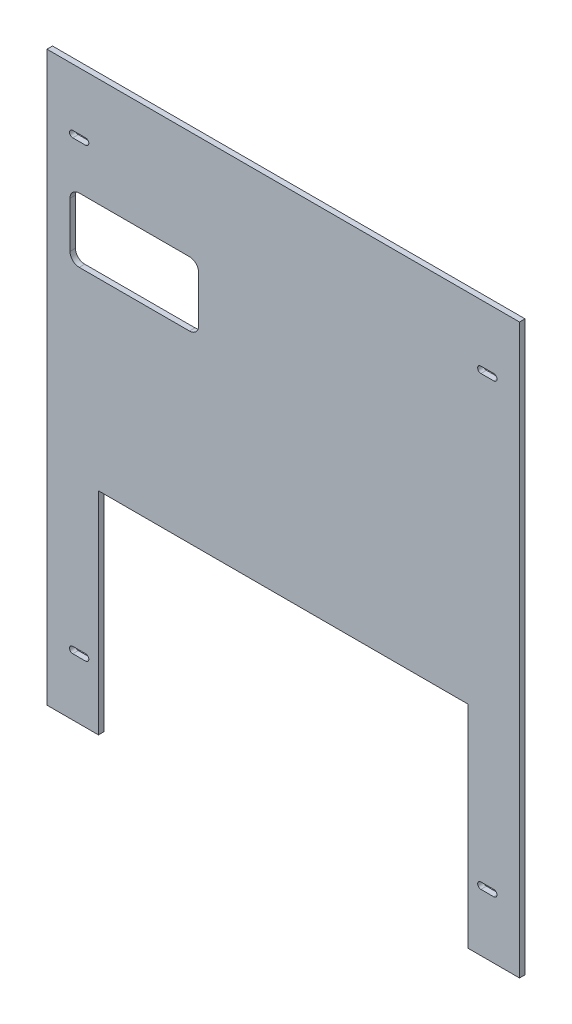
ISO-10303-21;
HEADER;
FILE_DESCRIPTION(('STEP AP214'),'2;1');
FILE_NAME('part.step','',(''),(''),'','','');
FILE_SCHEMA(('AUTOMOTIVE_DESIGN { 1 0 10303 214 1 1 1 1 }'));
ENDSEC;
DATA;
#1=APPLICATION_CONTEXT('core data for automotive mechanical design processes');
#2=APPLICATION_PROTOCOL_DEFINITION('international standard','automotive_design',2000,#1);
#3=PRODUCT_CONTEXT('',#1,'mechanical');
#4=PRODUCT('Part','Part','',(#3));
#5=PRODUCT_RELATED_PRODUCT_CATEGORY('part','',(#4));
#6=PRODUCT_DEFINITION_FORMATION('','',#4);
#7=PRODUCT_DEFINITION_CONTEXT('part definition',#1,'design');
#8=PRODUCT_DEFINITION('design','',#6,#7);
#9=PRODUCT_DEFINITION_SHAPE('','',#8);
#10=(LENGTH_UNIT() NAMED_UNIT(*) SI_UNIT(.MILLI.,.METRE.));
#11=(NAMED_UNIT(*) PLANE_ANGLE_UNIT() SI_UNIT($,.RADIAN.));
#12=(NAMED_UNIT(*) SI_UNIT($,.STERADIAN.) SOLID_ANGLE_UNIT());
#13=UNCERTAINTY_MEASURE_WITH_UNIT(LENGTH_MEASURE(1.E-05),#10,'distance_accuracy_value','');
#14=(GEOMETRIC_REPRESENTATION_CONTEXT(3) GLOBAL_UNCERTAINTY_ASSIGNED_CONTEXT((#13)) GLOBAL_UNIT_ASSIGNED_CONTEXT((#10,
#11,#12)) REPRESENTATION_CONTEXT('',''));
#15=CARTESIAN_POINT('',(0.,0.,0.));
#16=DIRECTION('',(0.,0.,1.));
#17=DIRECTION('',(1.,0.,0.));
#18=AXIS2_PLACEMENT_3D('',#15,#16,#17);
#19=CARTESIAN_POINT('',(128.5,-154.5,3.));
#20=DIRECTION('',(0.,1.,0.));
#21=DIRECTION('',(-1.,0.,0.));
#22=AXIS2_PLACEMENT_3D('',#19,#20,#21);
#23=PLANE('',#22);
#24=DIRECTION('',(1.,0.,0.));
#25=VECTOR('',#24,1.);
#26=CARTESIAN_POINT('',(128.5,-154.5,0.));
#27=LINE('',#26,#25);
#28=CARTESIAN_POINT('',(-128.5,-154.5,0.));
#29=VERTEX_POINT('',#28);
#30=CARTESIAN_POINT('',(-100.5,-154.5,0.));
#31=VERTEX_POINT('',#30);
#32=EDGE_CURVE('E532',#29,#31,#27,.T.);
#33=ORIENTED_EDGE('',*,*,#32,.T.);
#34=DIRECTION('',(0.,0.,1.));
#35=VECTOR('',#34,1.);
#36=CARTESIAN_POINT('',(-100.5,-154.5,0.));
#37=LINE('',#36,#35);
#38=CARTESIAN_POINT('',(-100.5,-154.5,3.));
#39=VERTEX_POINT('',#38);
#40=EDGE_CURVE('E334',#31,#39,#37,.T.);
#41=ORIENTED_EDGE('',*,*,#40,.T.);
#42=DIRECTION('',(1.,0.,0.));
#43=VECTOR('',#42,1.);
#44=CARTESIAN_POINT('',(128.5,-154.5,3.));
#45=LINE('',#44,#43);
#46=CARTESIAN_POINT('',(-128.5,-154.5,3.));
#47=VERTEX_POINT('',#46);
#48=EDGE_CURVE('E516',#47,#39,#45,.T.);
#49=ORIENTED_EDGE('',*,*,#48,.F.);
#50=DIRECTION('',(0.,0.,-1.));
#51=VECTOR('',#50,1.);
#52=CARTESIAN_POINT('',(-128.5,-154.5,3.));
#53=LINE('',#52,#51);
#54=EDGE_CURVE('E12',#47,#29,#53,.T.);
#55=ORIENTED_EDGE('',*,*,#54,.T.);
#56=EDGE_LOOP('',(#33,#41,#49,#55));
#57=FACE_BOUND('',#56,.T.);
#58=ADVANCED_FACE('F48',(#57),#23,.F.);
#59=CARTESIAN_POINT('',(0.,0.,3.));
#60=DIRECTION('',(0.,0.,-1.));
#61=DIRECTION('',(-1.,0.,0.));
#62=AXIS2_PLACEMENT_3D('',#59,#60,#61);
#63=PLANE('',#62);
#64=DIRECTION('',(1.,0.,0.));
#65=VECTOR('',#64,1.);
#66=CARTESIAN_POINT('',(-111.,60.5000000000001,3.));
#67=LINE('',#66,#65);
#68=CARTESIAN_POINT('',(-111.,60.5000000000001,3.));
#69=VERTEX_POINT('',#68);
#70=CARTESIAN_POINT('',(-51.,60.5000000000001,3.));
#71=VERTEX_POINT('',#70);
#72=EDGE_CURVE('E297',#69,#71,#67,.T.);
#73=ORIENTED_EDGE('',*,*,#72,.F.);
#74=CARTESIAN_POINT('',(-111.,65.5000000000001,3.));
#75=DIRECTION('',(0.,0.,1.));
#76=DIRECTION('',(-1.,0.,0.));
#77=AXIS2_PLACEMENT_3D('',#74,#75,#76);
#78=CIRCLE('',#77,5.);
#79=CARTESIAN_POINT('',(-116.,65.5000000000001,3.));
#80=VERTEX_POINT('',#79);
#81=EDGE_CURVE('E63',#80,#69,#78,.T.);
#82=ORIENTED_EDGE('',*,*,#81,.F.);
#83=DIRECTION('',(0.,-1.,0.));
#84=VECTOR('',#83,1.);
#85=CARTESIAN_POINT('',(-116.,65.5000000000001,3.));
#86=LINE('',#85,#84);
#87=CARTESIAN_POINT('',(-116.,90.5000000000001,3.));
#88=VERTEX_POINT('',#87);
#89=EDGE_CURVE('E276',#88,#80,#86,.T.);
#90=ORIENTED_EDGE('',*,*,#89,.F.);
#91=CARTESIAN_POINT('',(-111.,90.5000000000001,3.));
#92=DIRECTION('',(0.,0.,1.));
#93=DIRECTION('',(-1.,0.,0.));
#94=AXIS2_PLACEMENT_3D('',#91,#92,#93);
#95=CIRCLE('',#94,5.);
#96=CARTESIAN_POINT('',(-111.,95.5000000000001,3.));
#97=VERTEX_POINT('',#96);
#98=EDGE_CURVE('E279',#97,#88,#95,.T.);
#99=ORIENTED_EDGE('',*,*,#98,.F.);
#100=DIRECTION('',(-1.,0.,0.));
#101=VECTOR('',#100,1.);
#102=CARTESIAN_POINT('',(-111.,95.5000000000001,3.));
#103=LINE('',#102,#101);
#104=CARTESIAN_POINT('',(-51.,95.5000000000001,3.));
#105=VERTEX_POINT('',#104);
#106=EDGE_CURVE('E720',#105,#97,#103,.T.);
#107=ORIENTED_EDGE('',*,*,#106,.F.);
#108=CARTESIAN_POINT('',(-51.,90.5000000000001,3.));
#109=DIRECTION('',(0.,0.,1.));
#110=DIRECTION('',(-1.,0.,0.));
#111=AXIS2_PLACEMENT_3D('',#108,#109,#110);
#112=CIRCLE('',#111,5.);
#113=CARTESIAN_POINT('',(-46.,90.5000000000001,3.));
#114=VERTEX_POINT('',#113);
#115=EDGE_CURVE('E713',#114,#105,#112,.T.);
#116=ORIENTED_EDGE('',*,*,#115,.F.);
#117=DIRECTION('',(0.,1.,0.));
#118=VECTOR('',#117,1.);
#119=CARTESIAN_POINT('',(-46.,65.5000000000001,3.));
#120=LINE('',#119,#118);
#121=CARTESIAN_POINT('',(-46.,65.5000000000001,3.));
#122=VERTEX_POINT('',#121);
#123=EDGE_CURVE('E711',#122,#114,#120,.T.);
#124=ORIENTED_EDGE('',*,*,#123,.F.);
#125=CARTESIAN_POINT('',(-51.,65.5000000000001,3.));
#126=DIRECTION('',(0.,0.,1.));
#127=DIRECTION('',(1.,0.,0.));
#128=AXIS2_PLACEMENT_3D('',#125,#126,#127);
#129=CIRCLE('',#128,5.);
#130=EDGE_CURVE('E710',#71,#122,#129,.T.);
#131=ORIENTED_EDGE('',*,*,#130,.F.);
#132=EDGE_LOOP('',(#73,#82,#90,#99,#107,#116,#124,#131));
#133=FACE_BOUND('',#132,.T.);
#134=CARTESIAN_POINT('',(-114.5,-121.5,3.));
#135=DIRECTION('',(0.,0.,1.));
#136=DIRECTION('',(1.,0.,0.));
#137=AXIS2_PLACEMENT_3D('',#134,#135,#136);
#138=CIRCLE('',#137,1.75);
#139=CARTESIAN_POINT('',(-114.5,-119.75,3.));
#140=VERTEX_POINT('',#139);
#141=CARTESIAN_POINT('',(-114.5,-123.25,3.));
#142=VERTEX_POINT('',#141);
#143=EDGE_CURVE('E397',#140,#142,#138,.T.);
#144=ORIENTED_EDGE('',*,*,#143,.F.);
#145=DIRECTION('',(-1.,0.,0.));
#146=VECTOR('',#145,1.);
#147=CARTESIAN_POINT('',(-114.5,-119.75,3.));
#148=LINE('',#147,#146);
#149=CARTESIAN_POINT('',(-107.5,-119.75,3.));
#150=VERTEX_POINT('',#149);
#151=EDGE_CURVE('E411',#150,#140,#148,.T.);
#152=ORIENTED_EDGE('',*,*,#151,.F.);
#153=CARTESIAN_POINT('',(-107.5,-121.5,3.));
#154=DIRECTION('',(0.,0.,1.));
#155=DIRECTION('',(1.,0.,0.));
#156=AXIS2_PLACEMENT_3D('',#153,#154,#155);
#157=CIRCLE('',#156,1.75);
#158=CARTESIAN_POINT('',(-107.5,-123.25,3.));
#159=VERTEX_POINT('',#158);
#160=EDGE_CURVE('E415',#159,#150,#157,.T.);
#161=ORIENTED_EDGE('',*,*,#160,.F.);
#162=DIRECTION('',(1.,0.,0.));
#163=VECTOR('',#162,1.);
#164=CARTESIAN_POINT('',(-114.5,-123.25,3.));
#165=LINE('',#164,#163);
#166=EDGE_CURVE('E400',#142,#159,#165,.T.);
#167=ORIENTED_EDGE('',*,*,#166,.F.);
#168=EDGE_LOOP('',(#144,#152,#161,#167));
#169=FACE_BOUND('',#168,.T.);
#170=CARTESIAN_POINT('',(-114.5,121.5,3.));
#171=DIRECTION('',(0.,0.,1.));
#172=DIRECTION('',(1.,0.,0.));
#173=AXIS2_PLACEMENT_3D('',#170,#171,#172);
#174=CIRCLE('',#173,1.75);
#175=CARTESIAN_POINT('',(-114.5,123.25,3.));
#176=VERTEX_POINT('',#175);
#177=CARTESIAN_POINT('',(-114.5,119.75,3.));
#178=VERTEX_POINT('',#177);
#179=EDGE_CURVE('E475',#176,#178,#174,.T.);
#180=ORIENTED_EDGE('',*,*,#179,.F.);
#181=DIRECTION('',(-1.,0.,0.));
#182=VECTOR('',#181,1.);
#183=CARTESIAN_POINT('',(-114.5,123.25,3.));
#184=LINE('',#183,#182);
#185=CARTESIAN_POINT('',(-107.5,123.25,3.));
#186=VERTEX_POINT('',#185);
#187=EDGE_CURVE('E486',#186,#176,#184,.T.);
#188=ORIENTED_EDGE('',*,*,#187,.F.);
#189=CARTESIAN_POINT('',(-107.5,121.5,3.));
#190=DIRECTION('',(0.,0.,1.));
#191=DIRECTION('',(1.,0.,0.));
#192=AXIS2_PLACEMENT_3D('',#189,#190,#191);
#193=CIRCLE('',#192,1.75);
#194=CARTESIAN_POINT('',(-107.5,119.75,3.));
#195=VERTEX_POINT('',#194);
#196=EDGE_CURVE('E490',#195,#186,#193,.T.);
#197=ORIENTED_EDGE('',*,*,#196,.F.);
#198=DIRECTION('',(1.,0.,0.));
#199=VECTOR('',#198,1.);
#200=CARTESIAN_POINT('',(-114.5,119.75,3.));
#201=LINE('',#200,#199);
#202=EDGE_CURVE('E478',#178,#195,#201,.T.);
#203=ORIENTED_EDGE('',*,*,#202,.F.);
#204=EDGE_LOOP('',(#180,#188,#197,#203));
#205=FACE_BOUND('',#204,.T.);
#206=ORIENTED_EDGE('',*,*,#48,.T.);
#207=DIRECTION('',(0.,-1.,0.));
#208=VECTOR('',#207,1.);
#209=CARTESIAN_POINT('',(-100.5,-154.5,3.));
#210=LINE('',#209,#208);
#211=CARTESIAN_POINT('',(-100.5,-39.4999999999999,3.));
#212=VERTEX_POINT('',#211);
#213=EDGE_CURVE('E312',#212,#39,#210,.T.);
#214=ORIENTED_EDGE('',*,*,#213,.F.);
#215=DIRECTION('',(-1.,0.,0.));
#216=VECTOR('',#215,1.);
#217=CARTESIAN_POINT('',(-100.5,-39.4999999999999,3.));
#218=LINE('',#217,#216);
#219=CARTESIAN_POINT('',(100.5,-39.4999999999999,3.));
#220=VERTEX_POINT('',#219);
#221=EDGE_CURVE('E328',#220,#212,#218,.T.);
#222=ORIENTED_EDGE('',*,*,#221,.F.);
#223=DIRECTION('',(0.,1.,0.));
#224=VECTOR('',#223,1.);
#225=CARTESIAN_POINT('',(100.5,-154.5,3.));
#226=LINE('',#225,#224);
#227=CARTESIAN_POINT('',(100.5,-154.5,3.));
#228=VERTEX_POINT('',#227);
#229=EDGE_CURVE('E337',#228,#220,#226,.T.);
#230=ORIENTED_EDGE('',*,*,#229,.F.);
#231=CARTESIAN_POINT('',(128.5,-154.5,3.));
#232=VERTEX_POINT('',#231);
#233=EDGE_CURVE('E514',#228,#232,#45,.T.);
#234=ORIENTED_EDGE('',*,*,#233,.T.);
#235=DIRECTION('',(0.,1.,0.));
#236=VECTOR('',#235,1.);
#237=CARTESIAN_POINT('',(128.5,154.5,3.));
#238=LINE('',#237,#236);
#239=CARTESIAN_POINT('',(128.5,154.5,3.));
#240=VERTEX_POINT('',#239);
#241=EDGE_CURVE('E520',#232,#240,#238,.T.);
#242=ORIENTED_EDGE('',*,*,#241,.T.);
#243=DIRECTION('',(-1.,0.,0.));
#244=VECTOR('',#243,1.);
#245=CARTESIAN_POINT('',(128.5,154.5,3.));
#246=LINE('',#245,#244);
#247=CARTESIAN_POINT('',(-128.5,154.5,3.));
#248=VERTEX_POINT('',#247);
#249=EDGE_CURVE('E525',#240,#248,#246,.T.);
#250=ORIENTED_EDGE('',*,*,#249,.T.);
#251=DIRECTION('',(0.,-1.,0.));
#252=VECTOR('',#251,1.);
#253=CARTESIAN_POINT('',(-128.5,154.5,3.));
#254=LINE('',#253,#252);
#255=EDGE_CURVE('E511',#248,#47,#254,.T.);
#256=ORIENTED_EDGE('',*,*,#255,.T.);
#257=EDGE_LOOP('',(#206,#214,#222,#230,#234,#242,#250,#256));
#258=FACE_BOUND('',#257,.T.);
#259=CARTESIAN_POINT('',(107.5,-121.5,3.));
#260=DIRECTION('',(0.,0.,1.));
#261=DIRECTION('',(1.,0.,0.));
#262=AXIS2_PLACEMENT_3D('',#259,#260,#261);
#263=CIRCLE('',#262,1.75);
#264=CARTESIAN_POINT('',(107.5,-119.75,3.));
#265=VERTEX_POINT('',#264);
#266=CARTESIAN_POINT('',(107.5,-123.25,3.));
#267=VERTEX_POINT('',#266);
#268=EDGE_CURVE('E437',#265,#267,#263,.T.);
#269=ORIENTED_EDGE('',*,*,#268,.F.);
#270=DIRECTION('',(-1.,0.,0.));
#271=VECTOR('',#270,1.);
#272=CARTESIAN_POINT('',(107.5,-119.75,3.));
#273=LINE('',#272,#271);
#274=CARTESIAN_POINT('',(114.5,-119.75,3.));
#275=VERTEX_POINT('',#274);
#276=EDGE_CURVE('E449',#275,#265,#273,.T.);
#277=ORIENTED_EDGE('',*,*,#276,.F.);
#278=CARTESIAN_POINT('',(114.5,-121.5,3.));
#279=DIRECTION('',(0.,0.,1.));
#280=DIRECTION('',(1.,0.,0.));
#281=AXIS2_PLACEMENT_3D('',#278,#279,#280);
#282=CIRCLE('',#281,1.75);
#283=CARTESIAN_POINT('',(114.5,-123.25,3.));
#284=VERTEX_POINT('',#283);
#285=EDGE_CURVE('E453',#284,#275,#282,.T.);
#286=ORIENTED_EDGE('',*,*,#285,.F.);
#287=DIRECTION('',(1.,0.,0.));
#288=VECTOR('',#287,1.);
#289=CARTESIAN_POINT('',(107.5,-123.25,3.));
#290=LINE('',#289,#288);
#291=EDGE_CURVE('E439',#267,#284,#290,.T.);
#292=ORIENTED_EDGE('',*,*,#291,.F.);
#293=EDGE_LOOP('',(#269,#277,#286,#292));
#294=FACE_BOUND('',#293,.T.);
#295=CARTESIAN_POINT('',(107.5,121.5,3.));
#296=DIRECTION('',(0.,0.,1.));
#297=DIRECTION('',(1.,0.,0.));
#298=AXIS2_PLACEMENT_3D('',#295,#296,#297);
#299=CIRCLE('',#298,1.75);
#300=CARTESIAN_POINT('',(107.5,123.25,3.));
#301=VERTEX_POINT('',#300);
#302=CARTESIAN_POINT('',(107.5,119.75,3.));
#303=VERTEX_POINT('',#302);
#304=EDGE_CURVE('E359',#301,#303,#299,.T.);
#305=ORIENTED_EDGE('',*,*,#304,.F.);
#306=DIRECTION('',(-1.,0.,0.));
#307=VECTOR('',#306,1.);
#308=CARTESIAN_POINT('',(107.5,123.25,3.));
#309=LINE('',#308,#307);
#310=CARTESIAN_POINT('',(114.5,123.25,3.));
#311=VERTEX_POINT('',#310);
#312=EDGE_CURVE('E371',#311,#301,#309,.T.);
#313=ORIENTED_EDGE('',*,*,#312,.F.);
#314=CARTESIAN_POINT('',(114.5,121.5,3.));
#315=DIRECTION('',(0.,0.,1.));
#316=DIRECTION('',(1.,0.,0.));
#317=AXIS2_PLACEMENT_3D('',#314,#315,#316);
#318=CIRCLE('',#317,1.75);
#319=CARTESIAN_POINT('',(114.5,119.75,3.));
#320=VERTEX_POINT('',#319);
#321=EDGE_CURVE('E375',#320,#311,#318,.T.);
#322=ORIENTED_EDGE('',*,*,#321,.F.);
#323=DIRECTION('',(1.,0.,0.));
#324=VECTOR('',#323,1.);
#325=CARTESIAN_POINT('',(107.5,119.75,3.));
#326=LINE('',#325,#324);
#327=EDGE_CURVE('E361',#303,#320,#326,.T.);
#328=ORIENTED_EDGE('',*,*,#327,.F.);
#329=EDGE_LOOP('',(#305,#313,#322,#328));
#330=FACE_BOUND('',#329,.T.);
#331=ADVANCED_FACE('F563',(#133,#169,#205,#258,#294,#330),#63,.F.);
#332=CARTESIAN_POINT('',(0.,0.,0.));
#333=DIRECTION('',(0.,0.,-1.));
#334=DIRECTION('',(-1.,0.,0.));
#335=AXIS2_PLACEMENT_3D('',#332,#333,#334);
#336=PLANE('',#335);
#337=CARTESIAN_POINT('',(-111.,65.5000000000001,0.));
#338=DIRECTION('',(0.,0.,1.));
#339=DIRECTION('',(-1.,0.,0.));
#340=AXIS2_PLACEMENT_3D('',#337,#338,#339);
#341=CIRCLE('',#340,5.);
#342=CARTESIAN_POINT('',(-116.,65.5000000000001,0.));
#343=VERTEX_POINT('',#342);
#344=CARTESIAN_POINT('',(-111.,60.5000000000001,0.));
#345=VERTEX_POINT('',#344);
#346=EDGE_CURVE('E259',#343,#345,#341,.T.);
#347=ORIENTED_EDGE('',*,*,#346,.T.);
#348=DIRECTION('',(1.,0.,0.));
#349=VECTOR('',#348,1.);
#350=CARTESIAN_POINT('',(-111.,60.5000000000001,0.));
#351=LINE('',#350,#349);
#352=CARTESIAN_POINT('',(-51.,60.5000000000001,0.));
#353=VERTEX_POINT('',#352);
#354=EDGE_CURVE('E268',#345,#353,#351,.T.);
#355=ORIENTED_EDGE('',*,*,#354,.T.);
#356=CARTESIAN_POINT('',(-51.,65.5000000000001,0.));
#357=DIRECTION('',(0.,0.,1.));
#358=DIRECTION('',(1.,0.,0.));
#359=AXIS2_PLACEMENT_3D('',#356,#357,#358);
#360=CIRCLE('',#359,5.);
#361=CARTESIAN_POINT('',(-46.,65.5000000000001,0.));
#362=VERTEX_POINT('',#361);
#363=EDGE_CURVE('E71',#353,#362,#360,.T.);
#364=ORIENTED_EDGE('',*,*,#363,.T.);
#365=DIRECTION('',(0.,1.,0.));
#366=VECTOR('',#365,1.);
#367=CARTESIAN_POINT('',(-46.,65.5000000000001,0.));
#368=LINE('',#367,#366);
#369=CARTESIAN_POINT('',(-46.,90.5000000000001,0.));
#370=VERTEX_POINT('',#369);
#371=EDGE_CURVE('E283',#362,#370,#368,.T.);
#372=ORIENTED_EDGE('',*,*,#371,.T.);
#373=CARTESIAN_POINT('',(-51.,90.5000000000001,0.));
#374=DIRECTION('',(0.,0.,1.));
#375=DIRECTION('',(-1.,0.,0.));
#376=AXIS2_PLACEMENT_3D('',#373,#374,#375);
#377=CIRCLE('',#376,5.);
#378=CARTESIAN_POINT('',(-51.,95.5000000000001,0.));
#379=VERTEX_POINT('',#378);
#380=EDGE_CURVE('E286',#370,#379,#377,.T.);
#381=ORIENTED_EDGE('',*,*,#380,.T.);
#382=DIRECTION('',(-1.,0.,0.));
#383=VECTOR('',#382,1.);
#384=CARTESIAN_POINT('',(-111.,95.5000000000001,0.));
#385=LINE('',#384,#383);
#386=CARTESIAN_POINT('',(-111.,95.5000000000001,0.));
#387=VERTEX_POINT('',#386);
#388=EDGE_CURVE('E289',#379,#387,#385,.T.);
#389=ORIENTED_EDGE('',*,*,#388,.T.);
#390=CARTESIAN_POINT('',(-111.,90.5000000000001,0.));
#391=DIRECTION('',(0.,0.,1.));
#392=DIRECTION('',(-1.,0.,0.));
#393=AXIS2_PLACEMENT_3D('',#390,#391,#392);
#394=CIRCLE('',#393,5.);
#395=CARTESIAN_POINT('',(-116.,90.5000000000001,0.));
#396=VERTEX_POINT('',#395);
#397=EDGE_CURVE('E292',#387,#396,#394,.T.);
#398=ORIENTED_EDGE('',*,*,#397,.T.);
#399=DIRECTION('',(0.,-1.,0.));
#400=VECTOR('',#399,1.);
#401=CARTESIAN_POINT('',(-116.,65.5000000000001,0.));
#402=LINE('',#401,#400);
#403=EDGE_CURVE('E265',#396,#343,#402,.T.);
#404=ORIENTED_EDGE('',*,*,#403,.T.);
#405=EDGE_LOOP('',(#347,#355,#364,#372,#381,#389,#398,#404));
#406=FACE_BOUND('',#405,.T.);
#407=DIRECTION('',(0.,-1.,0.));
#408=VECTOR('',#407,1.);
#409=CARTESIAN_POINT('',(-100.5,-154.5,0.));
#410=LINE('',#409,#408);
#411=CARTESIAN_POINT('',(-100.5,-39.4999999999999,0.));
#412=VERTEX_POINT('',#411);
#413=EDGE_CURVE('E324',#412,#31,#410,.T.);
#414=ORIENTED_EDGE('',*,*,#413,.T.);
#415=ORIENTED_EDGE('',*,*,#32,.F.);
#416=DIRECTION('',(0.,-1.,0.));
#417=VECTOR('',#416,1.);
#418=CARTESIAN_POINT('',(-128.5,154.5,0.));
#419=LINE('',#418,#417);
#420=CARTESIAN_POINT('',(-128.5,154.5,0.));
#421=VERTEX_POINT('',#420);
#422=EDGE_CURVE('E510',#421,#29,#419,.T.);
#423=ORIENTED_EDGE('',*,*,#422,.F.);
#424=DIRECTION('',(-1.,0.,0.));
#425=VECTOR('',#424,1.);
#426=CARTESIAN_POINT('',(128.5,154.5,0.));
#427=LINE('',#426,#425);
#428=CARTESIAN_POINT('',(128.5,154.5,0.));
#429=VERTEX_POINT('',#428);
#430=EDGE_CURVE('E515',#429,#421,#427,.T.);
#431=ORIENTED_EDGE('',*,*,#430,.F.);
#432=DIRECTION('',(0.,1.,0.));
#433=VECTOR('',#432,1.);
#434=CARTESIAN_POINT('',(128.5,154.5,0.));
#435=LINE('',#434,#433);
#436=CARTESIAN_POINT('',(128.5,-154.5,0.));
#437=VERTEX_POINT('',#436);
#438=EDGE_CURVE('E535',#437,#429,#435,.T.);
#439=ORIENTED_EDGE('',*,*,#438,.F.);
#440=CARTESIAN_POINT('',(100.5,-154.5,0.));
#441=VERTEX_POINT('',#440);
#442=EDGE_CURVE('E531',#441,#437,#27,.T.);
#443=ORIENTED_EDGE('',*,*,#442,.F.);
#444=DIRECTION('',(0.,1.,0.));
#445=VECTOR('',#444,1.);
#446=CARTESIAN_POINT('',(100.5,-154.5,0.));
#447=LINE('',#446,#445);
#448=CARTESIAN_POINT('',(100.5,-39.4999999999999,0.));
#449=VERTEX_POINT('',#448);
#450=EDGE_CURVE('E327',#441,#449,#447,.T.);
#451=ORIENTED_EDGE('',*,*,#450,.T.);
#452=DIRECTION('',(-1.,0.,0.));
#453=VECTOR('',#452,1.);
#454=CARTESIAN_POINT('',(-100.5,-39.4999999999999,0.));
#455=LINE('',#454,#453);
#456=EDGE_CURVE('E331',#449,#412,#455,.T.);
#457=ORIENTED_EDGE('',*,*,#456,.T.);
#458=EDGE_LOOP('',(#414,#415,#423,#431,#439,#443,#451,#457));
#459=FACE_BOUND('',#458,.T.);
#460=DIRECTION('',(-1.,0.,0.));
#461=VECTOR('',#460,1.);
#462=CARTESIAN_POINT('',(-114.5,123.25,0.));
#463=LINE('',#462,#461);
#464=CARTESIAN_POINT('',(-107.5,123.25,0.));
#465=VERTEX_POINT('',#464);
#466=CARTESIAN_POINT('',(-114.5,123.25,0.));
#467=VERTEX_POINT('',#466);
#468=EDGE_CURVE('E479',#465,#467,#463,.T.);
#469=ORIENTED_EDGE('',*,*,#468,.T.);
#470=CARTESIAN_POINT('',(-114.5,121.5,0.));
#471=DIRECTION('',(0.,0.,1.));
#472=DIRECTION('',(1.,0.,0.));
#473=AXIS2_PLACEMENT_3D('',#470,#471,#472);
#474=CIRCLE('',#473,1.75);
#475=CARTESIAN_POINT('',(-114.5,119.75,0.));
#476=VERTEX_POINT('',#475);
#477=EDGE_CURVE('E474',#467,#476,#474,.T.);
#478=ORIENTED_EDGE('',*,*,#477,.T.);
#479=DIRECTION('',(1.,0.,0.));
#480=VECTOR('',#479,1.);
#481=CARTESIAN_POINT('',(-114.5,119.75,0.));
#482=LINE('',#481,#480);
#483=CARTESIAN_POINT('',(-107.5,119.75,0.));
#484=VERTEX_POINT('',#483);
#485=EDGE_CURVE('E494',#476,#484,#482,.T.);
#486=ORIENTED_EDGE('',*,*,#485,.T.);
#487=CARTESIAN_POINT('',(-107.5,121.5,0.));
#488=DIRECTION('',(0.,0.,1.));
#489=DIRECTION('',(1.,0.,0.));
#490=AXIS2_PLACEMENT_3D('',#487,#488,#489);
#491=CIRCLE('',#490,1.75);
#492=EDGE_CURVE('E497',#484,#465,#491,.T.);
#493=ORIENTED_EDGE('',*,*,#492,.T.);
#494=EDGE_LOOP('',(#469,#478,#486,#493));
#495=FACE_BOUND('',#494,.T.);
#496=DIRECTION('',(-1.,0.,0.));
#497=VECTOR('',#496,1.);
#498=CARTESIAN_POINT('',(107.5,-119.75,0.));
#499=LINE('',#498,#497);
#500=CARTESIAN_POINT('',(114.5,-119.75,0.));
#501=VERTEX_POINT('',#500);
#502=CARTESIAN_POINT('',(107.5,-119.75,0.));
#503=VERTEX_POINT('',#502);
#504=EDGE_CURVE('E440',#501,#503,#499,.T.);
#505=ORIENTED_EDGE('',*,*,#504,.T.);
#506=CARTESIAN_POINT('',(107.5,-121.5,0.));
#507=DIRECTION('',(0.,0.,1.));
#508=DIRECTION('',(1.,0.,0.));
#509=AXIS2_PLACEMENT_3D('',#506,#507,#508);
#510=CIRCLE('',#509,1.75);
#511=CARTESIAN_POINT('',(107.5,-123.25,0.));
#512=VERTEX_POINT('',#511);
#513=EDGE_CURVE('E436',#503,#512,#510,.T.);
#514=ORIENTED_EDGE('',*,*,#513,.T.);
#515=DIRECTION('',(1.,0.,0.));
#516=VECTOR('',#515,1.);
#517=CARTESIAN_POINT('',(107.5,-123.25,0.));
#518=LINE('',#517,#516);
#519=CARTESIAN_POINT('',(114.5,-123.25,0.));
#520=VERTEX_POINT('',#519);
#521=EDGE_CURVE('E457',#512,#520,#518,.T.);
#522=ORIENTED_EDGE('',*,*,#521,.T.);
#523=CARTESIAN_POINT('',(114.5,-121.5,0.));
#524=DIRECTION('',(0.,0.,1.));
#525=DIRECTION('',(1.,0.,0.));
#526=AXIS2_PLACEMENT_3D('',#523,#524,#525);
#527=CIRCLE('',#526,1.75);
#528=EDGE_CURVE('E460',#520,#501,#527,.T.);
#529=ORIENTED_EDGE('',*,*,#528,.T.);
#530=EDGE_LOOP('',(#505,#514,#522,#529));
#531=FACE_BOUND('',#530,.T.);
#532=DIRECTION('',(-1.,0.,0.));
#533=VECTOR('',#532,1.);
#534=CARTESIAN_POINT('',(-114.5,-119.75,0.));
#535=LINE('',#534,#533);
#536=CARTESIAN_POINT('',(-107.5,-119.75,0.));
#537=VERTEX_POINT('',#536);
#538=CARTESIAN_POINT('',(-114.5,-119.75,0.));
#539=VERTEX_POINT('',#538);
#540=EDGE_CURVE('E401',#537,#539,#535,.T.);
#541=ORIENTED_EDGE('',*,*,#540,.T.);
#542=CARTESIAN_POINT('',(-114.5,-121.5,0.));
#543=DIRECTION('',(0.,0.,1.));
#544=DIRECTION('',(1.,0.,0.));
#545=AXIS2_PLACEMENT_3D('',#542,#543,#544);
#546=CIRCLE('',#545,1.75);
#547=CARTESIAN_POINT('',(-114.5,-123.25,0.));
#548=VERTEX_POINT('',#547);
#549=EDGE_CURVE('E396',#539,#548,#546,.T.);
#550=ORIENTED_EDGE('',*,*,#549,.T.);
#551=DIRECTION('',(1.,0.,0.));
#552=VECTOR('',#551,1.);
#553=CARTESIAN_POINT('',(-114.5,-123.25,0.));
#554=LINE('',#553,#552);
#555=CARTESIAN_POINT('',(-107.5,-123.25,0.));
#556=VERTEX_POINT('',#555);
#557=EDGE_CURVE('E419',#548,#556,#554,.T.);
#558=ORIENTED_EDGE('',*,*,#557,.T.);
#559=CARTESIAN_POINT('',(-107.5,-121.5,0.));
#560=DIRECTION('',(0.,0.,1.));
#561=DIRECTION('',(1.,0.,0.));
#562=AXIS2_PLACEMENT_3D('',#559,#560,#561);
#563=CIRCLE('',#562,1.75);
#564=EDGE_CURVE('E422',#556,#537,#563,.T.);
#565=ORIENTED_EDGE('',*,*,#564,.T.);
#566=EDGE_LOOP('',(#541,#550,#558,#565));
#567=FACE_BOUND('',#566,.T.);
#568=DIRECTION('',(-1.,0.,0.));
#569=VECTOR('',#568,1.);
#570=CARTESIAN_POINT('',(107.5,123.25,0.));
#571=LINE('',#570,#569);
#572=CARTESIAN_POINT('',(114.5,123.25,0.));
#573=VERTEX_POINT('',#572);
#574=CARTESIAN_POINT('',(107.5,123.25,0.));
#575=VERTEX_POINT('',#574);
#576=EDGE_CURVE('E362',#573,#575,#571,.T.);
#577=ORIENTED_EDGE('',*,*,#576,.T.);
#578=CARTESIAN_POINT('',(107.5,121.5,0.));
#579=DIRECTION('',(0.,0.,1.));
#580=DIRECTION('',(1.,0.,0.));
#581=AXIS2_PLACEMENT_3D('',#578,#579,#580);
#582=CIRCLE('',#581,1.75);
#583=CARTESIAN_POINT('',(107.5,119.75,0.));
#584=VERTEX_POINT('',#583);
#585=EDGE_CURVE('E352',#575,#584,#582,.T.);
#586=ORIENTED_EDGE('',*,*,#585,.T.);
#587=DIRECTION('',(1.,0.,0.));
#588=VECTOR('',#587,1.);
#589=CARTESIAN_POINT('',(107.5,119.75,0.));
#590=LINE('',#589,#588);
#591=CARTESIAN_POINT('',(114.5,119.75,0.));
#592=VERTEX_POINT('',#591);
#593=EDGE_CURVE('E379',#584,#592,#590,.T.);
#594=ORIENTED_EDGE('',*,*,#593,.T.);
#595=CARTESIAN_POINT('',(114.5,121.5,0.));
#596=DIRECTION('',(0.,0.,1.));
#597=DIRECTION('',(1.,0.,0.));
#598=AXIS2_PLACEMENT_3D('',#595,#596,#597);
#599=CIRCLE('',#598,1.75);
#600=EDGE_CURVE('E382',#592,#573,#599,.T.);
#601=ORIENTED_EDGE('',*,*,#600,.T.);
#602=EDGE_LOOP('',(#577,#586,#594,#601));
#603=FACE_BOUND('',#602,.T.);
#604=ADVANCED_FACE('F272',(#406,#459,#495,#531,#567,#603),#336,.T.);
#605=CARTESIAN_POINT('',(-128.5,154.5,3.));
#606=DIRECTION('',(1.,0.,0.));
#607=DIRECTION('',(0.,0.,-1.));
#608=AXIS2_PLACEMENT_3D('',#605,#606,#607);
#609=PLANE('',#608);
#610=ORIENTED_EDGE('',*,*,#422,.T.);
#611=ORIENTED_EDGE('',*,*,#54,.F.);
#612=ORIENTED_EDGE('',*,*,#255,.F.);
#613=DIRECTION('',(0.,0.,-1.));
#614=VECTOR('',#613,1.);
#615=CARTESIAN_POINT('',(-128.5,154.5,3.));
#616=LINE('',#615,#614);
#617=EDGE_CURVE('E528',#248,#421,#616,.T.);
#618=ORIENTED_EDGE('',*,*,#617,.T.);
#619=EDGE_LOOP('',(#610,#611,#612,#618));
#620=FACE_BOUND('',#619,.T.);
#621=ADVANCED_FACE('F50',(#620),#609,.F.);
#622=ORIENTED_EDGE('',*,*,#233,.F.);
#623=DIRECTION('',(0.,0.,1.));
#624=VECTOR('',#623,1.);
#625=CARTESIAN_POINT('',(100.5,-154.5,0.));
#626=LINE('',#625,#624);
#627=EDGE_CURVE('E355',#441,#228,#626,.T.);
#628=ORIENTED_EDGE('',*,*,#627,.F.);
#629=ORIENTED_EDGE('',*,*,#442,.T.);
#630=DIRECTION('',(0.,0.,-1.));
#631=VECTOR('',#630,1.);
#632=CARTESIAN_POINT('',(128.5,-154.5,3.));
#633=LINE('',#632,#631);
#634=EDGE_CURVE('E56',#232,#437,#633,.T.);
#635=ORIENTED_EDGE('',*,*,#634,.F.);
#636=EDGE_LOOP('',(#622,#628,#629,#635));
#637=FACE_BOUND('',#636,.T.);
#638=ADVANCED_FACE('F570',(#637),#23,.F.);
#639=CARTESIAN_POINT('',(128.5,154.5,3.));
#640=DIRECTION('',(-1.,0.,0.));
#641=DIRECTION('',(0.,-1.,0.));
#642=AXIS2_PLACEMENT_3D('',#639,#640,#641);
#643=PLANE('',#642);
#644=ORIENTED_EDGE('',*,*,#438,.T.);
#645=DIRECTION('',(0.,0.,-1.));
#646=VECTOR('',#645,1.);
#647=CARTESIAN_POINT('',(128.5,154.5,3.));
#648=LINE('',#647,#646);
#649=EDGE_CURVE('E540',#240,#429,#648,.T.);
#650=ORIENTED_EDGE('',*,*,#649,.F.);
#651=ORIENTED_EDGE('',*,*,#241,.F.);
#652=ORIENTED_EDGE('',*,*,#634,.T.);
#653=EDGE_LOOP('',(#644,#650,#651,#652));
#654=FACE_BOUND('',#653,.T.);
#655=ADVANCED_FACE('F547',(#654),#643,.F.);
#656=CARTESIAN_POINT('',(128.5,154.5,3.));
#657=DIRECTION('',(0.,-1.,0.));
#658=DIRECTION('',(1.,0.,0.));
#659=AXIS2_PLACEMENT_3D('',#656,#657,#658);
#660=PLANE('',#659);
#661=ORIENTED_EDGE('',*,*,#430,.T.);
#662=ORIENTED_EDGE('',*,*,#617,.F.);
#663=ORIENTED_EDGE('',*,*,#249,.F.);
#664=ORIENTED_EDGE('',*,*,#649,.T.);
#665=EDGE_LOOP('',(#661,#662,#663,#664));
#666=FACE_BOUND('',#665,.T.);
#667=ADVANCED_FACE('F557',(#666),#660,.F.);
#668=CARTESIAN_POINT('',(-114.5,121.5,3.));
#669=DIRECTION('',(0.,0.,-1.));
#670=DIRECTION('',(-1.,0.,0.));
#671=AXIS2_PLACEMENT_3D('',#668,#669,#670);
#672=CYLINDRICAL_SURFACE('',#671,1.75);
#673=ORIENTED_EDGE('',*,*,#477,.F.);
#674=DIRECTION('',(0.,0.,-1.));
#675=VECTOR('',#674,1.);
#676=CARTESIAN_POINT('',(-114.5,123.25,3.));
#677=LINE('',#676,#675);
#678=EDGE_CURVE('E489',#176,#467,#677,.T.);
#679=ORIENTED_EDGE('',*,*,#678,.F.);
#680=ORIENTED_EDGE('',*,*,#179,.T.);
#681=DIRECTION('',(0.,0.,-1.));
#682=VECTOR('',#681,1.);
#683=CARTESIAN_POINT('',(-114.5,119.75,3.));
#684=LINE('',#683,#682);
#685=EDGE_CURVE('E508',#178,#476,#684,.T.);
#686=ORIENTED_EDGE('',*,*,#685,.T.);
#687=EDGE_LOOP('',(#673,#679,#680,#686));
#688=FACE_BOUND('',#687,.T.);
#689=ADVANCED_FACE('F604',(#688),#672,.F.);
#690=CARTESIAN_POINT('',(-114.5,119.75,3.));
#691=DIRECTION('',(0.,1.,0.));
#692=DIRECTION('',(0.,0.,1.));
#693=AXIS2_PLACEMENT_3D('',#690,#691,#692);
#694=PLANE('',#693);
#695=ORIENTED_EDGE('',*,*,#485,.F.);
#696=ORIENTED_EDGE('',*,*,#685,.F.);
#697=ORIENTED_EDGE('',*,*,#202,.T.);
#698=DIRECTION('',(0.,0.,-1.));
#699=VECTOR('',#698,1.);
#700=CARTESIAN_POINT('',(-107.5,119.75,3.));
#701=LINE('',#700,#699);
#702=EDGE_CURVE('E506',#195,#484,#701,.T.);
#703=ORIENTED_EDGE('',*,*,#702,.T.);
#704=EDGE_LOOP('',(#695,#696,#697,#703));
#705=FACE_BOUND('',#704,.T.);
#706=ADVANCED_FACE('F608',(#705),#694,.T.);
#707=CARTESIAN_POINT('',(-107.5,121.5,3.));
#708=DIRECTION('',(0.,0.,-1.));
#709=DIRECTION('',(-1.,0.,0.));
#710=AXIS2_PLACEMENT_3D('',#707,#708,#709);
#711=CYLINDRICAL_SURFACE('',#710,1.75);
#712=ORIENTED_EDGE('',*,*,#492,.F.);
#713=ORIENTED_EDGE('',*,*,#702,.F.);
#714=ORIENTED_EDGE('',*,*,#196,.T.);
#715=DIRECTION('',(0.,0.,-1.));
#716=VECTOR('',#715,1.);
#717=CARTESIAN_POINT('',(-107.5,123.25,3.));
#718=LINE('',#717,#716);
#719=EDGE_CURVE('E504',#186,#465,#718,.T.);
#720=ORIENTED_EDGE('',*,*,#719,.T.);
#721=EDGE_LOOP('',(#712,#713,#714,#720));
#722=FACE_BOUND('',#721,.T.);
#723=ADVANCED_FACE('F613',(#722),#711,.F.);
#724=CARTESIAN_POINT('',(-114.5,123.25,3.));
#725=DIRECTION('',(0.,-1.,0.));
#726=DIRECTION('',(0.,0.,-1.));
#727=AXIS2_PLACEMENT_3D('',#724,#725,#726);
#728=PLANE('',#727);
#729=ORIENTED_EDGE('',*,*,#468,.F.);
#730=ORIENTED_EDGE('',*,*,#719,.F.);
#731=ORIENTED_EDGE('',*,*,#187,.T.);
#732=ORIENTED_EDGE('',*,*,#678,.T.);
#733=EDGE_LOOP('',(#729,#730,#731,#732));
#734=FACE_BOUND('',#733,.T.);
#735=ADVANCED_FACE('F619',(#734),#728,.T.);
#736=CARTESIAN_POINT('',(107.5,-121.5,3.));
#737=DIRECTION('',(0.,0.,-1.));
#738=DIRECTION('',(-1.,0.,0.));
#739=AXIS2_PLACEMENT_3D('',#736,#737,#738);
#740=CYLINDRICAL_SURFACE('',#739,1.75);
#741=ORIENTED_EDGE('',*,*,#513,.F.);
#742=DIRECTION('',(0.,0.,-1.));
#743=VECTOR('',#742,1.);
#744=CARTESIAN_POINT('',(107.5,-119.75,3.));
#745=LINE('',#744,#743);
#746=EDGE_CURVE('E452',#265,#503,#745,.T.);
#747=ORIENTED_EDGE('',*,*,#746,.F.);
#748=ORIENTED_EDGE('',*,*,#268,.T.);
#749=DIRECTION('',(0.,0.,-1.));
#750=VECTOR('',#749,1.);
#751=CARTESIAN_POINT('',(107.5,-123.25,3.));
#752=LINE('',#751,#750);
#753=EDGE_CURVE('E471',#267,#512,#752,.T.);
#754=ORIENTED_EDGE('',*,*,#753,.T.);
#755=EDGE_LOOP('',(#741,#747,#748,#754));
#756=FACE_BOUND('',#755,.T.);
#757=ADVANCED_FACE('F623',(#756),#740,.F.);
#758=CARTESIAN_POINT('',(107.5,-123.25,3.));
#759=DIRECTION('',(0.,1.,0.));
#760=DIRECTION('',(0.,0.,1.));
#761=AXIS2_PLACEMENT_3D('',#758,#759,#760);
#762=PLANE('',#761);
#763=ORIENTED_EDGE('',*,*,#521,.F.);
#764=ORIENTED_EDGE('',*,*,#753,.F.);
#765=ORIENTED_EDGE('',*,*,#291,.T.);
#766=DIRECTION('',(0.,0.,-1.));
#767=VECTOR('',#766,1.);
#768=CARTESIAN_POINT('',(114.5,-123.25,3.));
#769=LINE('',#768,#767);
#770=EDGE_CURVE('E469',#284,#520,#769,.T.);
#771=ORIENTED_EDGE('',*,*,#770,.T.);
#772=EDGE_LOOP('',(#763,#764,#765,#771));
#773=FACE_BOUND('',#772,.T.);
#774=ADVANCED_FACE('F627',(#773),#762,.T.);
#775=CARTESIAN_POINT('',(114.5,-121.5,3.));
#776=DIRECTION('',(0.,0.,-1.));
#777=DIRECTION('',(-1.,0.,0.));
#778=AXIS2_PLACEMENT_3D('',#775,#776,#777);
#779=CYLINDRICAL_SURFACE('',#778,1.75);
#780=ORIENTED_EDGE('',*,*,#528,.F.);
#781=ORIENTED_EDGE('',*,*,#770,.F.);
#782=ORIENTED_EDGE('',*,*,#285,.T.);
#783=DIRECTION('',(0.,0.,-1.));
#784=VECTOR('',#783,1.);
#785=CARTESIAN_POINT('',(114.5,-119.75,3.));
#786=LINE('',#785,#784);
#787=EDGE_CURVE('E467',#275,#501,#786,.T.);
#788=ORIENTED_EDGE('',*,*,#787,.T.);
#789=EDGE_LOOP('',(#780,#781,#782,#788));
#790=FACE_BOUND('',#789,.T.);
#791=ADVANCED_FACE('F631',(#790),#779,.F.);
#792=CARTESIAN_POINT('',(107.5,-119.75,3.));
#793=DIRECTION('',(0.,-1.,0.));
#794=DIRECTION('',(0.,0.,-1.));
#795=AXIS2_PLACEMENT_3D('',#792,#793,#794);
#796=PLANE('',#795);
#797=ORIENTED_EDGE('',*,*,#504,.F.);
#798=ORIENTED_EDGE('',*,*,#787,.F.);
#799=ORIENTED_EDGE('',*,*,#276,.T.);
#800=ORIENTED_EDGE('',*,*,#746,.T.);
#801=EDGE_LOOP('',(#797,#798,#799,#800));
#802=FACE_BOUND('',#801,.T.);
#803=ADVANCED_FACE('F635',(#802),#796,.T.);
#804=CARTESIAN_POINT('',(-114.5,-121.5,3.));
#805=DIRECTION('',(0.,0.,-1.));
#806=DIRECTION('',(-1.,0.,0.));
#807=AXIS2_PLACEMENT_3D('',#804,#805,#806);
#808=CYLINDRICAL_SURFACE('',#807,1.75);
#809=ORIENTED_EDGE('',*,*,#549,.F.);
#810=DIRECTION('',(0.,0.,-1.));
#811=VECTOR('',#810,1.);
#812=CARTESIAN_POINT('',(-114.5,-119.75,3.));
#813=LINE('',#812,#811);
#814=EDGE_CURVE('E414',#140,#539,#813,.T.);
#815=ORIENTED_EDGE('',*,*,#814,.F.);
#816=ORIENTED_EDGE('',*,*,#143,.T.);
#817=DIRECTION('',(0.,0.,-1.));
#818=VECTOR('',#817,1.);
#819=CARTESIAN_POINT('',(-114.5,-123.25,3.));
#820=LINE('',#819,#818);
#821=EDGE_CURVE('E433',#142,#548,#820,.T.);
#822=ORIENTED_EDGE('',*,*,#821,.T.);
#823=EDGE_LOOP('',(#809,#815,#816,#822));
#824=FACE_BOUND('',#823,.T.);
#825=ADVANCED_FACE('F639',(#824),#808,.F.);
#826=CARTESIAN_POINT('',(-114.5,-123.25,3.));
#827=DIRECTION('',(0.,1.,0.));
#828=DIRECTION('',(0.,0.,1.));
#829=AXIS2_PLACEMENT_3D('',#826,#827,#828);
#830=PLANE('',#829);
#831=ORIENTED_EDGE('',*,*,#557,.F.);
#832=ORIENTED_EDGE('',*,*,#821,.F.);
#833=ORIENTED_EDGE('',*,*,#166,.T.);
#834=DIRECTION('',(0.,0.,-1.));
#835=VECTOR('',#834,1.);
#836=CARTESIAN_POINT('',(-107.5,-123.25,3.));
#837=LINE('',#836,#835);
#838=EDGE_CURVE('E431',#159,#556,#837,.T.);
#839=ORIENTED_EDGE('',*,*,#838,.T.);
#840=EDGE_LOOP('',(#831,#832,#833,#839));
#841=FACE_BOUND('',#840,.T.);
#842=ADVANCED_FACE('F643',(#841),#830,.T.);
#843=CARTESIAN_POINT('',(-107.5,-121.5,3.));
#844=DIRECTION('',(0.,0.,-1.));
#845=DIRECTION('',(-1.,0.,0.));
#846=AXIS2_PLACEMENT_3D('',#843,#844,#845);
#847=CYLINDRICAL_SURFACE('',#846,1.75);
#848=ORIENTED_EDGE('',*,*,#564,.F.);
#849=ORIENTED_EDGE('',*,*,#838,.F.);
#850=ORIENTED_EDGE('',*,*,#160,.T.);
#851=DIRECTION('',(0.,0.,-1.));
#852=VECTOR('',#851,1.);
#853=CARTESIAN_POINT('',(-107.5,-119.75,3.));
#854=LINE('',#853,#852);
#855=EDGE_CURVE('E429',#150,#537,#854,.T.);
#856=ORIENTED_EDGE('',*,*,#855,.T.);
#857=EDGE_LOOP('',(#848,#849,#850,#856));
#858=FACE_BOUND('',#857,.T.);
#859=ADVANCED_FACE('F647',(#858),#847,.F.);
#860=CARTESIAN_POINT('',(-114.5,-119.75,3.));
#861=DIRECTION('',(0.,-1.,0.));
#862=DIRECTION('',(0.,0.,-1.));
#863=AXIS2_PLACEMENT_3D('',#860,#861,#862);
#864=PLANE('',#863);
#865=ORIENTED_EDGE('',*,*,#540,.F.);
#866=ORIENTED_EDGE('',*,*,#855,.F.);
#867=ORIENTED_EDGE('',*,*,#151,.T.);
#868=ORIENTED_EDGE('',*,*,#814,.T.);
#869=EDGE_LOOP('',(#865,#866,#867,#868));
#870=FACE_BOUND('',#869,.T.);
#871=ADVANCED_FACE('F651',(#870),#864,.T.);
#872=CARTESIAN_POINT('',(107.5,121.5,3.));
#873=DIRECTION('',(0.,0.,-1.));
#874=DIRECTION('',(-1.,0.,0.));
#875=AXIS2_PLACEMENT_3D('',#872,#873,#874);
#876=CYLINDRICAL_SURFACE('',#875,1.75);
#877=ORIENTED_EDGE('',*,*,#585,.F.);
#878=DIRECTION('',(0.,0.,-1.));
#879=VECTOR('',#878,1.);
#880=CARTESIAN_POINT('',(107.5,123.25,3.));
#881=LINE('',#880,#879);
#882=EDGE_CURVE('E374',#301,#575,#881,.T.);
#883=ORIENTED_EDGE('',*,*,#882,.F.);
#884=ORIENTED_EDGE('',*,*,#304,.T.);
#885=DIRECTION('',(0.,0.,-1.));
#886=VECTOR('',#885,1.);
#887=CARTESIAN_POINT('',(107.5,119.75,3.));
#888=LINE('',#887,#886);
#889=EDGE_CURVE('E393',#303,#584,#888,.T.);
#890=ORIENTED_EDGE('',*,*,#889,.T.);
#891=EDGE_LOOP('',(#877,#883,#884,#890));
#892=FACE_BOUND('',#891,.T.);
#893=ADVANCED_FACE('F655',(#892),#876,.F.);
#894=CARTESIAN_POINT('',(107.5,119.75,3.));
#895=DIRECTION('',(0.,1.,0.));
#896=DIRECTION('',(0.,0.,1.));
#897=AXIS2_PLACEMENT_3D('',#894,#895,#896);
#898=PLANE('',#897);
#899=ORIENTED_EDGE('',*,*,#593,.F.);
#900=ORIENTED_EDGE('',*,*,#889,.F.);
#901=ORIENTED_EDGE('',*,*,#327,.T.);
#902=DIRECTION('',(0.,0.,-1.));
#903=VECTOR('',#902,1.);
#904=CARTESIAN_POINT('',(114.5,119.75,3.));
#905=LINE('',#904,#903);
#906=EDGE_CURVE('E391',#320,#592,#905,.T.);
#907=ORIENTED_EDGE('',*,*,#906,.T.);
#908=EDGE_LOOP('',(#899,#900,#901,#907));
#909=FACE_BOUND('',#908,.T.);
#910=ADVANCED_FACE('F659',(#909),#898,.T.);
#911=CARTESIAN_POINT('',(114.5,121.5,3.));
#912=DIRECTION('',(0.,0.,-1.));
#913=DIRECTION('',(-1.,0.,0.));
#914=AXIS2_PLACEMENT_3D('',#911,#912,#913);
#915=CYLINDRICAL_SURFACE('',#914,1.75);
#916=ORIENTED_EDGE('',*,*,#600,.F.);
#917=ORIENTED_EDGE('',*,*,#906,.F.);
#918=ORIENTED_EDGE('',*,*,#321,.T.);
#919=DIRECTION('',(0.,0.,-1.));
#920=VECTOR('',#919,1.);
#921=CARTESIAN_POINT('',(114.5,123.25,3.));
#922=LINE('',#921,#920);
#923=EDGE_CURVE('E389',#311,#573,#922,.T.);
#924=ORIENTED_EDGE('',*,*,#923,.T.);
#925=EDGE_LOOP('',(#916,#917,#918,#924));
#926=FACE_BOUND('',#925,.T.);
#927=ADVANCED_FACE('F663',(#926),#915,.F.);
#928=CARTESIAN_POINT('',(107.5,123.25,3.));
#929=DIRECTION('',(0.,-1.,0.));
#930=DIRECTION('',(0.,0.,-1.));
#931=AXIS2_PLACEMENT_3D('',#928,#929,#930);
#932=PLANE('',#931);
#933=ORIENTED_EDGE('',*,*,#576,.F.);
#934=ORIENTED_EDGE('',*,*,#923,.F.);
#935=ORIENTED_EDGE('',*,*,#312,.T.);
#936=ORIENTED_EDGE('',*,*,#882,.T.);
#937=EDGE_LOOP('',(#933,#934,#935,#936));
#938=FACE_BOUND('',#937,.T.);
#939=ADVANCED_FACE('F667',(#938),#932,.T.);
#940=CARTESIAN_POINT('',(-100.5,-154.5,0.));
#941=DIRECTION('',(-1.,0.,0.));
#942=DIRECTION('',(0.,0.,1.));
#943=AXIS2_PLACEMENT_3D('',#940,#941,#942);
#944=PLANE('',#943);
#945=ORIENTED_EDGE('',*,*,#213,.T.);
#946=ORIENTED_EDGE('',*,*,#40,.F.);
#947=ORIENTED_EDGE('',*,*,#413,.F.);
#948=DIRECTION('',(0.,0.,1.));
#949=VECTOR('',#948,1.);
#950=CARTESIAN_POINT('',(-100.5,-39.4999999999999,0.));
#951=LINE('',#950,#949);
#952=EDGE_CURVE('E350',#412,#212,#951,.T.);
#953=ORIENTED_EDGE('',*,*,#952,.T.);
#954=EDGE_LOOP('',(#945,#946,#947,#953));
#955=FACE_BOUND('',#954,.T.);
#956=ADVANCED_FACE('F578',(#955),#944,.F.);
#957=CARTESIAN_POINT('',(-100.5,-39.4999999999999,0.));
#958=DIRECTION('',(0.,1.,0.));
#959=DIRECTION('',(0.,0.,1.));
#960=AXIS2_PLACEMENT_3D('',#957,#958,#959);
#961=PLANE('',#960);
#962=ORIENTED_EDGE('',*,*,#221,.T.);
#963=ORIENTED_EDGE('',*,*,#952,.F.);
#964=ORIENTED_EDGE('',*,*,#456,.F.);
#965=DIRECTION('',(0.,0.,1.));
#966=VECTOR('',#965,1.);
#967=CARTESIAN_POINT('',(100.5,-39.4999999999999,0.));
#968=LINE('',#967,#966);
#969=EDGE_CURVE('E353',#449,#220,#968,.T.);
#970=ORIENTED_EDGE('',*,*,#969,.T.);
#971=EDGE_LOOP('',(#962,#963,#964,#970));
#972=FACE_BOUND('',#971,.T.);
#973=ADVANCED_FACE('F576',(#972),#961,.F.);
#974=CARTESIAN_POINT('',(100.5,-154.5,0.));
#975=DIRECTION('',(1.,0.,0.));
#976=DIRECTION('',(0.,1.,0.));
#977=AXIS2_PLACEMENT_3D('',#974,#975,#976);
#978=PLANE('',#977);
#979=ORIENTED_EDGE('',*,*,#229,.T.);
#980=ORIENTED_EDGE('',*,*,#969,.F.);
#981=ORIENTED_EDGE('',*,*,#450,.F.);
#982=ORIENTED_EDGE('',*,*,#627,.T.);
#983=EDGE_LOOP('',(#979,#980,#981,#982));
#984=FACE_BOUND('',#983,.T.);
#985=ADVANCED_FACE('F572',(#984),#978,.F.);
#986=CARTESIAN_POINT('',(-111.,65.5000000000001,0.));
#987=DIRECTION('',(0.,0.,1.));
#988=DIRECTION('',(1.,0.,0.));
#989=AXIS2_PLACEMENT_3D('',#986,#987,#988);
#990=CYLINDRICAL_SURFACE('',#989,5.);
#991=ORIENTED_EDGE('',*,*,#81,.T.);
#992=DIRECTION('',(0.,0.,1.));
#993=VECTOR('',#992,1.);
#994=CARTESIAN_POINT('',(-111.,60.5000000000001,0.));
#995=LINE('',#994,#993);
#996=EDGE_CURVE('E255',#345,#69,#995,.T.);
#997=ORIENTED_EDGE('',*,*,#996,.F.);
#998=ORIENTED_EDGE('',*,*,#346,.F.);
#999=DIRECTION('',(0.,0.,1.));
#1000=VECTOR('',#999,1.);
#1001=CARTESIAN_POINT('',(-116.,65.5000000000001,0.));
#1002=LINE('',#1001,#1000);
#1003=EDGE_CURVE('E310',#343,#80,#1002,.T.);
#1004=ORIENTED_EDGE('',*,*,#1003,.T.);
#1005=EDGE_LOOP('',(#991,#997,#998,#1004));
#1006=FACE_BOUND('',#1005,.T.);
#1007=ADVANCED_FACE('F257',(#1006),#990,.F.);
#1008=CARTESIAN_POINT('',(-116.,65.5000000000001,0.));
#1009=DIRECTION('',(-1.,0.,0.));
#1010=DIRECTION('',(0.,0.,1.));
#1011=AXIS2_PLACEMENT_3D('',#1008,#1009,#1010);
#1012=PLANE('',#1011);
#1013=ORIENTED_EDGE('',*,*,#89,.T.);
#1014=ORIENTED_EDGE('',*,*,#1003,.F.);
#1015=ORIENTED_EDGE('',*,*,#403,.F.);
#1016=DIRECTION('',(0.,0.,1.));
#1017=VECTOR('',#1016,1.);
#1018=CARTESIAN_POINT('',(-116.,90.5000000000001,0.));
#1019=LINE('',#1018,#1017);
#1020=EDGE_CURVE('E313',#396,#88,#1019,.T.);
#1021=ORIENTED_EDGE('',*,*,#1020,.T.);
#1022=EDGE_LOOP('',(#1013,#1014,#1015,#1021));
#1023=FACE_BOUND('',#1022,.T.);
#1024=ADVANCED_FACE('F677',(#1023),#1012,.F.);
#1025=CARTESIAN_POINT('',(-111.,90.5000000000001,0.));
#1026=DIRECTION('',(0.,0.,1.));
#1027=DIRECTION('',(1.,0.,0.));
#1028=AXIS2_PLACEMENT_3D('',#1025,#1026,#1027);
#1029=CYLINDRICAL_SURFACE('',#1028,5.);
#1030=ORIENTED_EDGE('',*,*,#98,.T.);
#1031=ORIENTED_EDGE('',*,*,#1020,.F.);
#1032=ORIENTED_EDGE('',*,*,#397,.F.);
#1033=DIRECTION('',(0.,0.,1.));
#1034=VECTOR('',#1033,1.);
#1035=CARTESIAN_POINT('',(-111.,95.5000000000001,0.));
#1036=LINE('',#1035,#1034);
#1037=EDGE_CURVE('E315',#387,#97,#1036,.T.);
#1038=ORIENTED_EDGE('',*,*,#1037,.T.);
#1039=EDGE_LOOP('',(#1030,#1031,#1032,#1038));
#1040=FACE_BOUND('',#1039,.T.);
#1041=ADVANCED_FACE('F694',(#1040),#1029,.F.);
#1042=CARTESIAN_POINT('',(-111.,95.5000000000001,0.));
#1043=DIRECTION('',(0.,1.,0.));
#1044=DIRECTION('',(0.,0.,1.));
#1045=AXIS2_PLACEMENT_3D('',#1042,#1043,#1044);
#1046=PLANE('',#1045);
#1047=ORIENTED_EDGE('',*,*,#106,.T.);
#1048=ORIENTED_EDGE('',*,*,#1037,.F.);
#1049=ORIENTED_EDGE('',*,*,#388,.F.);
#1050=DIRECTION('',(0.,0.,1.));
#1051=VECTOR('',#1050,1.);
#1052=CARTESIAN_POINT('',(-51.,95.5000000000001,0.));
#1053=LINE('',#1052,#1051);
#1054=EDGE_CURVE('E317',#379,#105,#1053,.T.);
#1055=ORIENTED_EDGE('',*,*,#1054,.T.);
#1056=EDGE_LOOP('',(#1047,#1048,#1049,#1055));
#1057=FACE_BOUND('',#1056,.T.);
#1058=ADVANCED_FACE('F690',(#1057),#1046,.F.);
#1059=CARTESIAN_POINT('',(-51.,90.5000000000001,0.));
#1060=DIRECTION('',(0.,0.,1.));
#1061=DIRECTION('',(1.,0.,0.));
#1062=AXIS2_PLACEMENT_3D('',#1059,#1060,#1061);
#1063=CYLINDRICAL_SURFACE('',#1062,5.);
#1064=ORIENTED_EDGE('',*,*,#115,.T.);
#1065=ORIENTED_EDGE('',*,*,#1054,.F.);
#1066=ORIENTED_EDGE('',*,*,#380,.F.);
#1067=DIRECTION('',(0.,0.,1.));
#1068=VECTOR('',#1067,1.);
#1069=CARTESIAN_POINT('',(-46.,90.5000000000001,0.));
#1070=LINE('',#1069,#1068);
#1071=EDGE_CURVE('E319',#370,#114,#1070,.T.);
#1072=ORIENTED_EDGE('',*,*,#1071,.T.);
#1073=EDGE_LOOP('',(#1064,#1065,#1066,#1072));
#1074=FACE_BOUND('',#1073,.T.);
#1075=ADVANCED_FACE('F686',(#1074),#1063,.F.);
#1076=CARTESIAN_POINT('',(-46.,65.5000000000001,0.));
#1077=DIRECTION('',(1.,0.,0.));
#1078=DIRECTION('',(0.,0.,-1.));
#1079=AXIS2_PLACEMENT_3D('',#1076,#1077,#1078);
#1080=PLANE('',#1079);
#1081=ORIENTED_EDGE('',*,*,#123,.T.);
#1082=ORIENTED_EDGE('',*,*,#1071,.F.);
#1083=ORIENTED_EDGE('',*,*,#371,.F.);
#1084=DIRECTION('',(0.,0.,1.));
#1085=VECTOR('',#1084,1.);
#1086=CARTESIAN_POINT('',(-46.,65.5000000000001,0.));
#1087=LINE('',#1086,#1085);
#1088=EDGE_CURVE('E321',#362,#122,#1087,.T.);
#1089=ORIENTED_EDGE('',*,*,#1088,.T.);
#1090=EDGE_LOOP('',(#1081,#1082,#1083,#1089));
#1091=FACE_BOUND('',#1090,.T.);
#1092=ADVANCED_FACE('F683',(#1091),#1080,.F.);
#1093=CARTESIAN_POINT('',(-51.,65.5000000000001,0.));
#1094=DIRECTION('',(0.,0.,1.));
#1095=DIRECTION('',(1.,0.,0.));
#1096=AXIS2_PLACEMENT_3D('',#1093,#1094,#1095);
#1097=CYLINDRICAL_SURFACE('',#1096,5.);
#1098=ORIENTED_EDGE('',*,*,#130,.T.);
#1099=ORIENTED_EDGE('',*,*,#1088,.F.);
#1100=ORIENTED_EDGE('',*,*,#363,.F.);
#1101=DIRECTION('',(0.,0.,1.));
#1102=VECTOR('',#1101,1.);
#1103=CARTESIAN_POINT('',(-51.,60.5000000000001,0.));
#1104=LINE('',#1103,#1102);
#1105=EDGE_CURVE('E264',#353,#71,#1104,.T.);
#1106=ORIENTED_EDGE('',*,*,#1105,.T.);
#1107=EDGE_LOOP('',(#1098,#1099,#1100,#1106));
#1108=FACE_BOUND('',#1107,.T.);
#1109=ADVANCED_FACE('F680',(#1108),#1097,.F.);
#1110=CARTESIAN_POINT('',(-111.,60.5000000000001,0.));
#1111=DIRECTION('',(0.,-1.,0.));
#1112=DIRECTION('',(0.,0.,-1.));
#1113=AXIS2_PLACEMENT_3D('',#1110,#1111,#1112);
#1114=PLANE('',#1113);
#1115=ORIENTED_EDGE('',*,*,#72,.T.);
#1116=ORIENTED_EDGE('',*,*,#1105,.F.);
#1117=ORIENTED_EDGE('',*,*,#354,.F.);
#1118=ORIENTED_EDGE('',*,*,#996,.T.);
#1119=EDGE_LOOP('',(#1115,#1116,#1117,#1118));
#1120=FACE_BOUND('',#1119,.T.);
#1121=ADVANCED_FACE('F269',(#1120),#1114,.F.);
#1122=CLOSED_SHELL('',(#58,#331,#604,#621,#638,#655,#667,#689,#706,#723,#735,#757,#774,#791,
#803,#825,#842,#859,#871,#893,#910,#927,#939,#956,#973,#985,#1007,#1024,#1041,#1058,#1075,#1092,
#1109,#1121));
#1123=MANIFOLD_SOLID_BREP('B2',#1122);
#1124=ADVANCED_BREP_SHAPE_REPRESENTATION('',(#18,#1123),#14);
#1125=SHAPE_DEFINITION_REPRESENTATION(#9,#1124);
ENDSEC;
END-ISO-10303-21;
